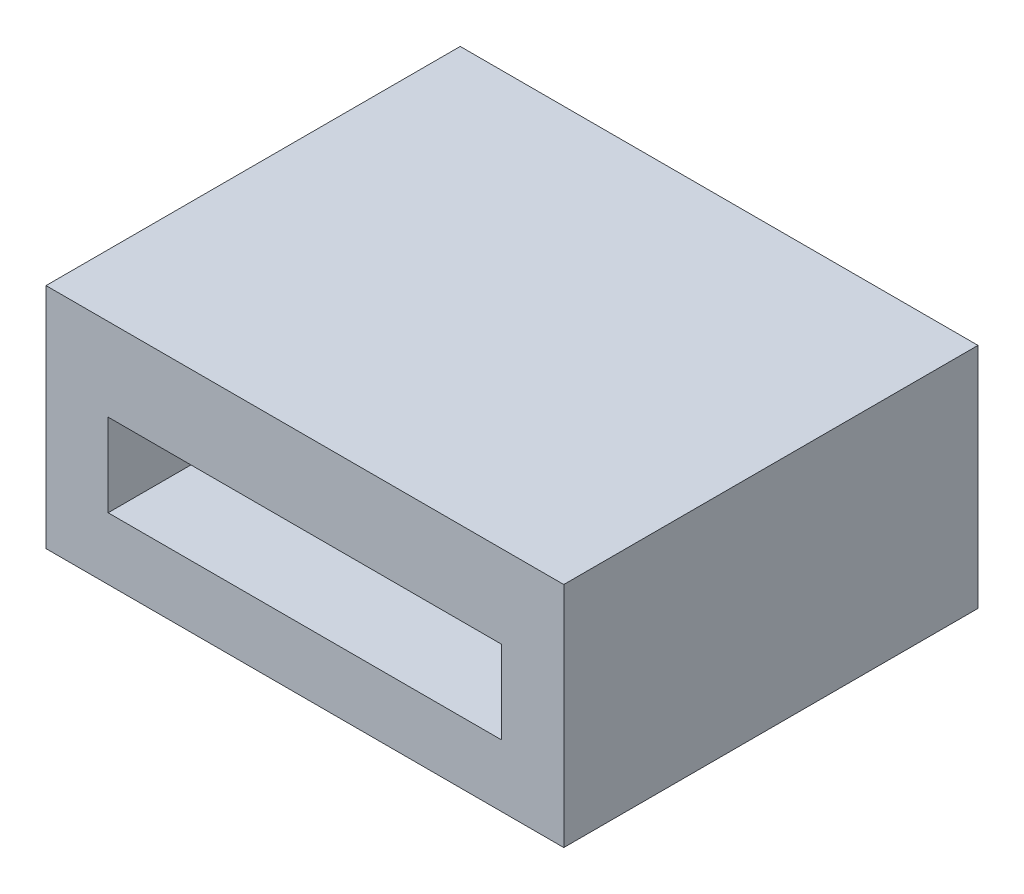
ISO-10303-21;
HEADER;
FILE_DESCRIPTION(('STEP AP214'),'2;1');
FILE_NAME('part.step','',(''),(''),'','','');
FILE_SCHEMA(('AUTOMOTIVE_DESIGN { 1 0 10303 214 1 1 1 1 }'));
ENDSEC;
DATA;
#1=APPLICATION_CONTEXT('core data for automotive mechanical design processes');
#2=APPLICATION_PROTOCOL_DEFINITION('international standard','automotive_design',2000,#1);
#3=PRODUCT_CONTEXT('',#1,'mechanical');
#4=PRODUCT('Part','Part','',(#3));
#5=PRODUCT_RELATED_PRODUCT_CATEGORY('part','',(#4));
#6=PRODUCT_DEFINITION_FORMATION('','',#4);
#7=PRODUCT_DEFINITION_CONTEXT('part definition',#1,'design');
#8=PRODUCT_DEFINITION('design','',#6,#7);
#9=PRODUCT_DEFINITION_SHAPE('','',#8);
#10=(LENGTH_UNIT() NAMED_UNIT(*) SI_UNIT(.MILLI.,.METRE.));
#11=(NAMED_UNIT(*) PLANE_ANGLE_UNIT() SI_UNIT($,.RADIAN.));
#12=(NAMED_UNIT(*) SI_UNIT($,.STERADIAN.) SOLID_ANGLE_UNIT());
#13=UNCERTAINTY_MEASURE_WITH_UNIT(LENGTH_MEASURE(1.E-05),#10,'distance_accuracy_value','');
#14=(GEOMETRIC_REPRESENTATION_CONTEXT(3) GLOBAL_UNCERTAINTY_ASSIGNED_CONTEXT((#13)) GLOBAL_UNIT_ASSIGNED_CONTEXT((#10,
#11,#12)) REPRESENTATION_CONTEXT('',''));
#15=CARTESIAN_POINT('',(0.,0.,0.));
#16=DIRECTION('',(0.,0.,1.));
#17=DIRECTION('',(1.,0.,0.));
#18=AXIS2_PLACEMENT_3D('',#15,#16,#17);
#19=CARTESIAN_POINT('',(0.,3.,0.));
#20=DIRECTION('',(0.,-1.,0.));
#21=DIRECTION('',(0.,0.,-1.));
#22=AXIS2_PLACEMENT_3D('',#19,#20,#21);
#23=PLANE('',#22);
#24=DIRECTION('',(0.,0.,1.));
#25=VECTOR('',#24,1.);
#26=CARTESIAN_POINT('',(22.,3.,-20.));
#27=LINE('',#26,#25);
#28=CARTESIAN_POINT('',(22.,3.,-20.));
#29=VERTEX_POINT('',#28);
#30=CARTESIAN_POINT('',(22.,3.,0.));
#31=VERTEX_POINT('',#30);
#32=EDGE_CURVE('E126',#29,#31,#27,.T.);
#33=ORIENTED_EDGE('',*,*,#32,.F.);
#34=DIRECTION('',(1.,0.,0.));
#35=VECTOR('',#34,1.);
#36=CARTESIAN_POINT('',(0.,3.,-20.));
#37=LINE('',#36,#35);
#38=CARTESIAN_POINT('',(3.,3.,-20.));
#39=VERTEX_POINT('',#38);
#40=EDGE_CURVE('E148',#39,#29,#37,.T.);
#41=ORIENTED_EDGE('',*,*,#40,.F.);
#42=DIRECTION('',(0.,0.,-1.));
#43=VECTOR('',#42,1.);
#44=CARTESIAN_POINT('',(3.,3.,-20.));
#45=LINE('',#44,#43);
#46=CARTESIAN_POINT('',(3.,3.,0.));
#47=VERTEX_POINT('',#46);
#48=EDGE_CURVE('E52',#47,#39,#45,.T.);
#49=ORIENTED_EDGE('',*,*,#48,.F.);
#50=DIRECTION('',(1.,0.,0.));
#51=VECTOR('',#50,1.);
#52=CARTESIAN_POINT('',(0.,3.,0.));
#53=LINE('',#52,#51);
#54=EDGE_CURVE('E151',#47,#31,#53,.T.);
#55=ORIENTED_EDGE('',*,*,#54,.T.);
#56=EDGE_LOOP('',(#33,#41,#49,#55));
#57=FACE_BOUND('',#56,.T.);
#58=ADVANCED_FACE('F35',(#57),#23,.F.);
#59=CARTESIAN_POINT('',(0.,3.,0.));
#60=DIRECTION('',(-1.,0.,0.));
#61=DIRECTION('',(0.,0.,1.));
#62=AXIS2_PLACEMENT_3D('',#59,#60,#61);
#63=PLANE('',#62);
#64=DIRECTION('',(0.,0.,-1.));
#65=VECTOR('',#64,1.);
#66=CARTESIAN_POINT('',(0.,0.,0.));
#67=LINE('',#66,#65);
#68=CARTESIAN_POINT('',(0.,0.,0.));
#69=VERTEX_POINT('',#68);
#70=CARTESIAN_POINT('',(0.,0.,-20.));
#71=VERTEX_POINT('',#70);
#72=EDGE_CURVE('E104',#69,#71,#67,.T.);
#73=ORIENTED_EDGE('',*,*,#72,.F.);
#74=DIRECTION('',(0.,-1.,0.));
#75=VECTOR('',#74,1.);
#76=CARTESIAN_POINT('',(0.,3.,0.));
#77=LINE('',#76,#75);
#78=CARTESIAN_POINT('',(0.,11.,0.));
#79=VERTEX_POINT('',#78);
#80=EDGE_CURVE('E11',#79,#69,#77,.T.);
#81=ORIENTED_EDGE('',*,*,#80,.F.);
#82=DIRECTION('',(0.,0.,1.));
#83=VECTOR('',#82,1.);
#84=CARTESIAN_POINT('',(0.,11.,-20.));
#85=LINE('',#84,#83);
#86=CARTESIAN_POINT('',(0.,11.,-20.));
#87=VERTEX_POINT('',#86);
#88=EDGE_CURVE('E102',#87,#79,#85,.T.);
#89=ORIENTED_EDGE('',*,*,#88,.F.);
#90=DIRECTION('',(0.,-1.,0.));
#91=VECTOR('',#90,1.);
#92=CARTESIAN_POINT('',(0.,3.,-20.));
#93=LINE('',#92,#91);
#94=EDGE_CURVE('E39',#87,#71,#93,.T.);
#95=ORIENTED_EDGE('',*,*,#94,.T.);
#96=EDGE_LOOP('',(#73,#81,#89,#95));
#97=FACE_BOUND('',#96,.T.);
#98=ADVANCED_FACE('F37',(#97),#63,.T.);
#99=CARTESIAN_POINT('',(0.,3.,0.));
#100=DIRECTION('',(0.,0.,-1.));
#101=DIRECTION('',(-1.,0.,0.));
#102=AXIS2_PLACEMENT_3D('',#99,#100,#101);
#103=PLANE('',#102);
#104=DIRECTION('',(0.,-1.,0.));
#105=VECTOR('',#104,1.);
#106=CARTESIAN_POINT('',(3.,7.,0.));
#107=LINE('',#106,#105);
#108=CARTESIAN_POINT('',(3.,7.,0.));
#109=VERTEX_POINT('',#108);
#110=EDGE_CURVE('E145',#109,#47,#107,.T.);
#111=ORIENTED_EDGE('',*,*,#110,.F.);
#112=DIRECTION('',(1.,0.,0.));
#113=VECTOR('',#112,1.);
#114=CARTESIAN_POINT('',(0.,7.,0.));
#115=LINE('',#114,#113);
#116=CARTESIAN_POINT('',(22.,7.,0.));
#117=VERTEX_POINT('',#116);
#118=EDGE_CURVE('E121',#109,#117,#115,.T.);
#119=ORIENTED_EDGE('',*,*,#118,.T.);
#120=DIRECTION('',(0.,-1.,0.));
#121=VECTOR('',#120,1.);
#122=CARTESIAN_POINT('',(22.,7.,0.));
#123=LINE('',#122,#121);
#124=EDGE_CURVE('E136',#117,#31,#123,.T.);
#125=ORIENTED_EDGE('',*,*,#124,.T.);
#126=ORIENTED_EDGE('',*,*,#54,.F.);
#127=EDGE_LOOP('',(#111,#119,#125,#126));
#128=FACE_BOUND('',#127,.T.);
#129=DIRECTION('',(1.,0.,0.));
#130=VECTOR('',#129,1.);
#131=CARTESIAN_POINT('',(0.,0.,0.));
#132=LINE('',#131,#130);
#133=CARTESIAN_POINT('',(25.,0.,0.));
#134=VERTEX_POINT('',#133);
#135=EDGE_CURVE('E152',#69,#134,#132,.T.);
#136=ORIENTED_EDGE('',*,*,#135,.T.);
#137=DIRECTION('',(0.,-1.,0.));
#138=VECTOR('',#137,1.);
#139=CARTESIAN_POINT('',(25.,3.,0.));
#140=LINE('',#139,#138);
#141=CARTESIAN_POINT('',(25.,11.,0.));
#142=VERTEX_POINT('',#141);
#143=EDGE_CURVE('E44',#142,#134,#140,.T.);
#144=ORIENTED_EDGE('',*,*,#143,.F.);
#145=DIRECTION('',(1.,0.,0.));
#146=VECTOR('',#145,1.);
#147=CARTESIAN_POINT('',(0.,11.,0.));
#148=LINE('',#147,#146);
#149=EDGE_CURVE('E106',#79,#142,#148,.T.);
#150=ORIENTED_EDGE('',*,*,#149,.F.);
#151=ORIENTED_EDGE('',*,*,#80,.T.);
#152=EDGE_LOOP('',(#136,#144,#150,#151));
#153=FACE_BOUND('',#152,.T.);
#154=ADVANCED_FACE('F107',(#128,#153),#103,.F.);
#155=CARTESIAN_POINT('',(25.,3.,0.));
#156=DIRECTION('',(-1.,0.,0.));
#157=DIRECTION('',(0.,0.,1.));
#158=AXIS2_PLACEMENT_3D('',#155,#156,#157);
#159=PLANE('',#158);
#160=DIRECTION('',(0.,0.,-1.));
#161=VECTOR('',#160,1.);
#162=CARTESIAN_POINT('',(25.,0.,0.));
#163=LINE('',#162,#161);
#164=CARTESIAN_POINT('',(25.,0.,-20.));
#165=VERTEX_POINT('',#164);
#166=EDGE_CURVE('E158',#134,#165,#163,.T.);
#167=ORIENTED_EDGE('',*,*,#166,.T.);
#168=DIRECTION('',(0.,-1.,0.));
#169=VECTOR('',#168,1.);
#170=CARTESIAN_POINT('',(25.,3.,-20.));
#171=LINE('',#170,#169);
#172=CARTESIAN_POINT('',(25.,11.,-20.));
#173=VERTEX_POINT('',#172);
#174=EDGE_CURVE('E162',#173,#165,#171,.T.);
#175=ORIENTED_EDGE('',*,*,#174,.F.);
#176=DIRECTION('',(0.,0.,-1.));
#177=VECTOR('',#176,1.);
#178=CARTESIAN_POINT('',(25.,11.,-20.));
#179=LINE('',#178,#177);
#180=EDGE_CURVE('E112',#142,#173,#179,.T.);
#181=ORIENTED_EDGE('',*,*,#180,.F.);
#182=ORIENTED_EDGE('',*,*,#143,.T.);
#183=EDGE_LOOP('',(#167,#175,#181,#182));
#184=FACE_BOUND('',#183,.T.);
#185=ADVANCED_FACE('F171',(#184),#159,.F.);
#186=CARTESIAN_POINT('',(0.,3.,-20.));
#187=DIRECTION('',(0.,0.,-1.));
#188=DIRECTION('',(-1.,0.,0.));
#189=AXIS2_PLACEMENT_3D('',#186,#187,#188);
#190=PLANE('',#189);
#191=ORIENTED_EDGE('',*,*,#94,.F.);
#192=DIRECTION('',(-1.,0.,0.));
#193=VECTOR('',#192,1.);
#194=CARTESIAN_POINT('',(0.,11.,-20.));
#195=LINE('',#194,#193);
#196=EDGE_CURVE('E117',#173,#87,#195,.T.);
#197=ORIENTED_EDGE('',*,*,#196,.F.);
#198=ORIENTED_EDGE('',*,*,#174,.T.);
#199=DIRECTION('',(1.,0.,0.));
#200=VECTOR('',#199,1.);
#201=CARTESIAN_POINT('',(0.,0.,-20.));
#202=LINE('',#201,#200);
#203=EDGE_CURVE('E155',#71,#165,#202,.T.);
#204=ORIENTED_EDGE('',*,*,#203,.F.);
#205=EDGE_LOOP('',(#191,#197,#198,#204));
#206=FACE_BOUND('',#205,.T.);
#207=DIRECTION('',(-1.,0.,0.));
#208=VECTOR('',#207,1.);
#209=CARTESIAN_POINT('',(0.,7.,-20.));
#210=LINE('',#209,#208);
#211=CARTESIAN_POINT('',(22.,7.,-20.));
#212=VERTEX_POINT('',#211);
#213=CARTESIAN_POINT('',(3.,7.,-20.));
#214=VERTEX_POINT('',#213);
#215=EDGE_CURVE('E118',#212,#214,#210,.T.);
#216=ORIENTED_EDGE('',*,*,#215,.T.);
#217=DIRECTION('',(0.,-1.,0.));
#218=VECTOR('',#217,1.);
#219=CARTESIAN_POINT('',(3.,7.,-20.));
#220=LINE('',#219,#218);
#221=EDGE_CURVE('E141',#214,#39,#220,.T.);
#222=ORIENTED_EDGE('',*,*,#221,.T.);
#223=ORIENTED_EDGE('',*,*,#40,.T.);
#224=DIRECTION('',(0.,-1.,0.));
#225=VECTOR('',#224,1.);
#226=CARTESIAN_POINT('',(22.,7.,-20.));
#227=LINE('',#226,#225);
#228=EDGE_CURVE('E132',#212,#29,#227,.T.);
#229=ORIENTED_EDGE('',*,*,#228,.F.);
#230=EDGE_LOOP('',(#216,#222,#223,#229));
#231=FACE_BOUND('',#230,.T.);
#232=ADVANCED_FACE('F165',(#206,#231),#190,.T.);
#233=CARTESIAN_POINT('',(0.,0.,0.));
#234=DIRECTION('',(0.,-1.,0.));
#235=DIRECTION('',(0.,0.,-1.));
#236=AXIS2_PLACEMENT_3D('',#233,#234,#235);
#237=PLANE('',#236);
#238=ORIENTED_EDGE('',*,*,#72,.T.);
#239=ORIENTED_EDGE('',*,*,#203,.T.);
#240=ORIENTED_EDGE('',*,*,#166,.F.);
#241=ORIENTED_EDGE('',*,*,#135,.F.);
#242=EDGE_LOOP('',(#238,#239,#240,#241));
#243=FACE_BOUND('',#242,.T.);
#244=ADVANCED_FACE('F169',(#243),#237,.T.);
#245=CARTESIAN_POINT('',(3.,7.,-20.));
#246=DIRECTION('',(-1.,0.,0.));
#247=DIRECTION('',(0.,0.,1.));
#248=AXIS2_PLACEMENT_3D('',#245,#246,#247);
#249=PLANE('',#248);
#250=ORIENTED_EDGE('',*,*,#48,.T.);
#251=ORIENTED_EDGE('',*,*,#221,.F.);
#252=DIRECTION('',(0.,0.,-1.));
#253=VECTOR('',#252,1.);
#254=CARTESIAN_POINT('',(3.,7.,-20.));
#255=LINE('',#254,#253);
#256=EDGE_CURVE('E138',#109,#214,#255,.T.);
#257=ORIENTED_EDGE('',*,*,#256,.F.);
#258=ORIENTED_EDGE('',*,*,#110,.T.);
#259=EDGE_LOOP('',(#250,#251,#257,#258));
#260=FACE_BOUND('',#259,.T.);
#261=ADVANCED_FACE('F188',(#260),#249,.F.);
#262=CARTESIAN_POINT('',(22.,7.,-20.));
#263=DIRECTION('',(1.,0.,0.));
#264=DIRECTION('',(0.,0.,-1.));
#265=AXIS2_PLACEMENT_3D('',#262,#263,#264);
#266=PLANE('',#265);
#267=ORIENTED_EDGE('',*,*,#32,.T.);
#268=ORIENTED_EDGE('',*,*,#124,.F.);
#269=DIRECTION('',(0.,0.,1.));
#270=VECTOR('',#269,1.);
#271=CARTESIAN_POINT('',(22.,7.,-20.));
#272=LINE('',#271,#270);
#273=EDGE_CURVE('E129',#212,#117,#272,.T.);
#274=ORIENTED_EDGE('',*,*,#273,.F.);
#275=ORIENTED_EDGE('',*,*,#228,.T.);
#276=EDGE_LOOP('',(#267,#268,#274,#275));
#277=FACE_BOUND('',#276,.T.);
#278=ADVANCED_FACE('F194',(#277),#266,.F.);
#279=CARTESIAN_POINT('',(0.,7.,0.));
#280=DIRECTION('',(0.,1.,0.));
#281=DIRECTION('',(0.,0.,1.));
#282=AXIS2_PLACEMENT_3D('',#279,#280,#281);
#283=PLANE('',#282);
#284=ORIENTED_EDGE('',*,*,#118,.F.);
#285=ORIENTED_EDGE('',*,*,#256,.T.);
#286=ORIENTED_EDGE('',*,*,#215,.F.);
#287=ORIENTED_EDGE('',*,*,#273,.T.);
#288=EDGE_LOOP('',(#284,#285,#286,#287));
#289=FACE_BOUND('',#288,.T.);
#290=ADVANCED_FACE('F199',(#289),#283,.F.);
#291=CARTESIAN_POINT('',(0.,11.,0.));
#292=DIRECTION('',(0.,1.,0.));
#293=DIRECTION('',(0.,0.,1.));
#294=AXIS2_PLACEMENT_3D('',#291,#292,#293);
#295=PLANE('',#294);
#296=ORIENTED_EDGE('',*,*,#88,.T.);
#297=ORIENTED_EDGE('',*,*,#149,.T.);
#298=ORIENTED_EDGE('',*,*,#180,.T.);
#299=ORIENTED_EDGE('',*,*,#196,.T.);
#300=EDGE_LOOP('',(#296,#297,#298,#299));
#301=FACE_BOUND('',#300,.T.);
#302=ADVANCED_FACE('F115',(#301),#295,.T.);
#303=CLOSED_SHELL('',(#58,#98,#154,#185,#232,#244,#261,#278,#290,#302));
#304=MANIFOLD_SOLID_BREP('B2',#303);
#305=ADVANCED_BREP_SHAPE_REPRESENTATION('',(#18,#304),#14);
#306=SHAPE_DEFINITION_REPRESENTATION(#9,#305);
ENDSEC;
END-ISO-10303-21;
